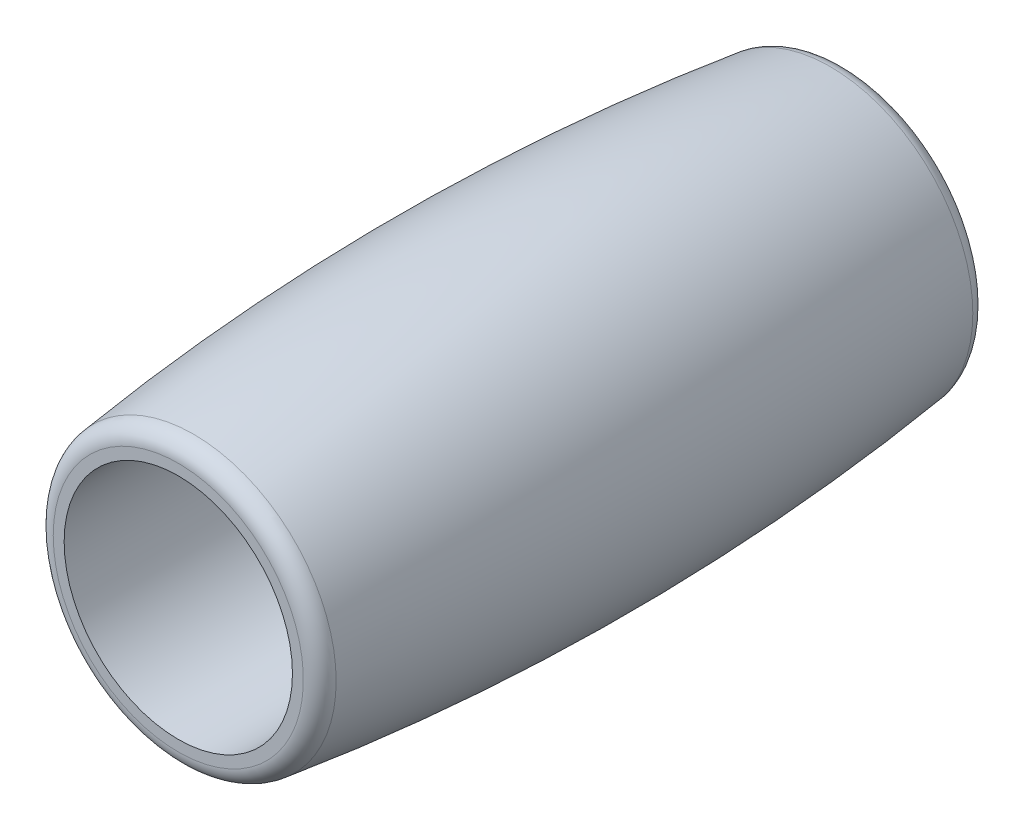
ISO-10303-21;
HEADER;
FILE_DESCRIPTION(('STEP AP214'),'2;1');
FILE_NAME('part.step','',(''),(''),'','','');
FILE_SCHEMA(('AUTOMOTIVE_DESIGN { 1 0 10303 214 1 1 1 1 }'));
ENDSEC;
DATA;
#1=APPLICATION_CONTEXT('core data for automotive mechanical design processes');
#2=APPLICATION_PROTOCOL_DEFINITION('international standard','automotive_design',2000,#1);
#3=PRODUCT_CONTEXT('',#1,'mechanical');
#4=PRODUCT('Part','Part','',(#3));
#5=PRODUCT_RELATED_PRODUCT_CATEGORY('part','',(#4));
#6=PRODUCT_DEFINITION_FORMATION('','',#4);
#7=PRODUCT_DEFINITION_CONTEXT('part definition',#1,'design');
#8=PRODUCT_DEFINITION('design','',#6,#7);
#9=PRODUCT_DEFINITION_SHAPE('','',#8);
#10=(LENGTH_UNIT() NAMED_UNIT(*) SI_UNIT(.MILLI.,.METRE.));
#11=(NAMED_UNIT(*) PLANE_ANGLE_UNIT() SI_UNIT($,.RADIAN.));
#12=(NAMED_UNIT(*) SI_UNIT($,.STERADIAN.) SOLID_ANGLE_UNIT());
#13=UNCERTAINTY_MEASURE_WITH_UNIT(LENGTH_MEASURE(1.E-05),#10,'distance_accuracy_value','');
#14=(GEOMETRIC_REPRESENTATION_CONTEXT(3) GLOBAL_UNCERTAINTY_ASSIGNED_CONTEXT((#13)) GLOBAL_UNIT_ASSIGNED_CONTEXT((#10,
#11,#12)) REPRESENTATION_CONTEXT('',''));
#15=CARTESIAN_POINT('',(0.,0.,0.));
#16=DIRECTION('',(0.,0.,1.));
#17=DIRECTION('',(1.,0.,0.));
#18=AXIS2_PLACEMENT_3D('',#15,#16,#17);
#19=CARTESIAN_POINT('',(0.,0.,-0.597114905425203));
#20=DIRECTION('',(0.,0.,-1.));
#21=DIRECTION('',(-1.,0.,0.));
#22=AXIS2_PLACEMENT_3D('',#19,#20,#21);
#23=DEGENERATE_TOROIDAL_SURFACE('',#22,135.775,145.025,.F.);
#24=CARTESIAN_POINT('',(0.,0.,-18.7220932078033));
#25=DIRECTION('',(0.,0.,1.));
#26=DIRECTION('',(1.,0.,0.));
#27=AXIS2_PLACEMENT_3D('',#24,#25,#26);
#28=CIRCLE('',#27,8.11292786936064);
#29=CARTESIAN_POINT('',(8.11292786936064,0.,-18.7220932078033));
#30=VERTEX_POINT('',#29);
#31=EDGE_CURVE('E10',#30,#30,#28,.T.);
#32=ORIENTED_EDGE('',*,*,#31,.T.);
#33=EDGE_LOOP('',(#32));
#34=FACE_BOUND('',#33,.T.);
#35=CARTESIAN_POINT('',(0.,0.,17.5278633969529));
#36=DIRECTION('',(0.,0.,-1.));
#37=DIRECTION('',(-1.,0.,0.));
#38=AXIS2_PLACEMENT_3D('',#35,#36,#37);
#39=CIRCLE('',#38,8.11292786936064);
#40=CARTESIAN_POINT('',(-8.11292786936064,0.,17.5278633969529));
#41=VERTEX_POINT('',#40);
#42=EDGE_CURVE('E57',#41,#41,#39,.T.);
#43=ORIENTED_EDGE('',*,*,#42,.T.);
#44=EDGE_LOOP('',(#43));
#45=FACE_BOUND('',#44,.T.);
#46=ADVANCED_FACE('F36',(#34,#45),#23,.F.);
#47=CARTESIAN_POINT('',(8.,0.,-19.5971149054252));
#48=DIRECTION('',(0.,0.,1.));
#49=DIRECTION('',(1.,0.,0.));
#50=AXIS2_PLACEMENT_3D('',#47,#48,#49);
#51=PLANE('',#50);
#52=CARTESIAN_POINT('',(0.,0.,-19.5971149054252));
#53=DIRECTION('',(0.,0.,1.));
#54=DIRECTION('',(1.,0.,0.));
#55=AXIS2_PLACEMENT_3D('',#52,#53,#54);
#56=CIRCLE('',#55,7.120768394309);
#57=CARTESIAN_POINT('',(7.120768394309,0.,-19.5971149054252));
#58=VERTEX_POINT('',#57);
#59=EDGE_CURVE('E44',#58,#58,#56,.F.);
#60=ORIENTED_EDGE('',*,*,#59,.T.);
#61=EDGE_LOOP('',(#60));
#62=FACE_BOUND('',#61,.T.);
#63=CARTESIAN_POINT('',(0.,0.,-19.5971149054252));
#64=DIRECTION('',(0.,0.,-1.));
#65=DIRECTION('',(-1.,0.,0.));
#66=AXIS2_PLACEMENT_3D('',#63,#64,#65);
#67=CIRCLE('',#66,6.5);
#68=CARTESIAN_POINT('',(-6.5,0.,-19.5971149054252));
#69=VERTEX_POINT('',#68);
#70=EDGE_CURVE('E62',#69,#69,#67,.T.);
#71=ORIENTED_EDGE('',*,*,#70,.F.);
#72=EDGE_LOOP('',(#71));
#73=FACE_BOUND('',#72,.T.);
#74=ADVANCED_FACE('F74',(#62,#73),#51,.F.);
#75=CARTESIAN_POINT('',(0.,0.,-17.5604191692568));
#76=DIRECTION('',(0.,0.,-1.));
#77=DIRECTION('',(-1.,0.,0.));
#78=AXIS2_PLACEMENT_3D('',#75,#76,#77);
#79=CYLINDRICAL_SURFACE('',#78,6.5);
#80=CARTESIAN_POINT('',(0.,0.,18.4028850945748));
#81=DIRECTION('',(0.,0.,-1.));
#82=DIRECTION('',(-1.,0.,0.));
#83=AXIS2_PLACEMENT_3D('',#80,#81,#82);
#84=CIRCLE('',#83,6.5);
#85=CARTESIAN_POINT('',(-6.5,0.,18.4028850945748));
#86=VERTEX_POINT('',#85);
#87=EDGE_CURVE('E65',#86,#86,#84,.T.);
#88=ORIENTED_EDGE('',*,*,#87,.F.);
#89=EDGE_LOOP('',(#88));
#90=FACE_BOUND('',#89,.T.);
#91=ORIENTED_EDGE('',*,*,#70,.T.);
#92=EDGE_LOOP('',(#91));
#93=FACE_BOUND('',#92,.T.);
#94=ADVANCED_FACE('F71',(#90,#93),#79,.F.);
#95=CARTESIAN_POINT('',(6.5,0.,18.4028850945748));
#96=DIRECTION('',(0.,0.,-1.));
#97=DIRECTION('',(-1.,0.,0.));
#98=AXIS2_PLACEMENT_3D('',#95,#96,#97);
#99=PLANE('',#98);
#100=CARTESIAN_POINT('',(0.,0.,18.4028850945748));
#101=DIRECTION('',(0.,0.,-1.));
#102=DIRECTION('',(-1.,0.,0.));
#103=AXIS2_PLACEMENT_3D('',#100,#101,#102);
#104=CIRCLE('',#103,7.120768394309);
#105=CARTESIAN_POINT('',(-7.120768394309,0.,18.4028850945748));
#106=VERTEX_POINT('',#105);
#107=EDGE_CURVE('E51',#106,#106,#104,.F.);
#108=ORIENTED_EDGE('',*,*,#107,.T.);
#109=EDGE_LOOP('',(#108));
#110=FACE_BOUND('',#109,.T.);
#111=ORIENTED_EDGE('',*,*,#87,.T.);
#112=EDGE_LOOP('',(#111));
#113=FACE_BOUND('',#112,.T.);
#114=ADVANCED_FACE('F69',(#110,#113),#99,.F.);
#115=CARTESIAN_POINT('',(0.,0.,17.4028850945748));
#116=DIRECTION('',(0.,0.,-1.));
#117=DIRECTION('',(-1.,0.,0.));
#118=AXIS2_PLACEMENT_3D('',#115,#116,#117);
#119=TOROIDAL_SURFACE('',#118,7.120768394309,1.);
#120=ORIENTED_EDGE('',*,*,#107,.F.);
#121=EDGE_LOOP('',(#120));
#122=FACE_BOUND('',#121,.T.);
#123=ORIENTED_EDGE('',*,*,#42,.F.);
#124=EDGE_LOOP('',(#123));
#125=FACE_BOUND('',#124,.T.);
#126=ADVANCED_FACE('F85',(#122,#125),#119,.T.);
#127=CARTESIAN_POINT('',(0.,0.,-18.5971149054252));
#128=DIRECTION('',(0.,0.,1.));
#129=DIRECTION('',(1.,0.,0.));
#130=AXIS2_PLACEMENT_3D('',#127,#128,#129);
#131=TOROIDAL_SURFACE('',#130,7.120768394309,1.);
#132=ORIENTED_EDGE('',*,*,#31,.F.);
#133=EDGE_LOOP('',(#132));
#134=FACE_BOUND('',#133,.T.);
#135=ORIENTED_EDGE('',*,*,#59,.F.);
#136=EDGE_LOOP('',(#135));
#137=FACE_BOUND('',#136,.T.);
#138=ADVANCED_FACE('F38',(#134,#137),#131,.T.);
#139=CLOSED_SHELL('',(#46,#74,#94,#114,#126,#138));
#140=MANIFOLD_SOLID_BREP('B2',#139);
#141=ADVANCED_BREP_SHAPE_REPRESENTATION('',(#18,#140),#14);
#142=SHAPE_DEFINITION_REPRESENTATION(#9,#141);
ENDSEC;
END-ISO-10303-21;
